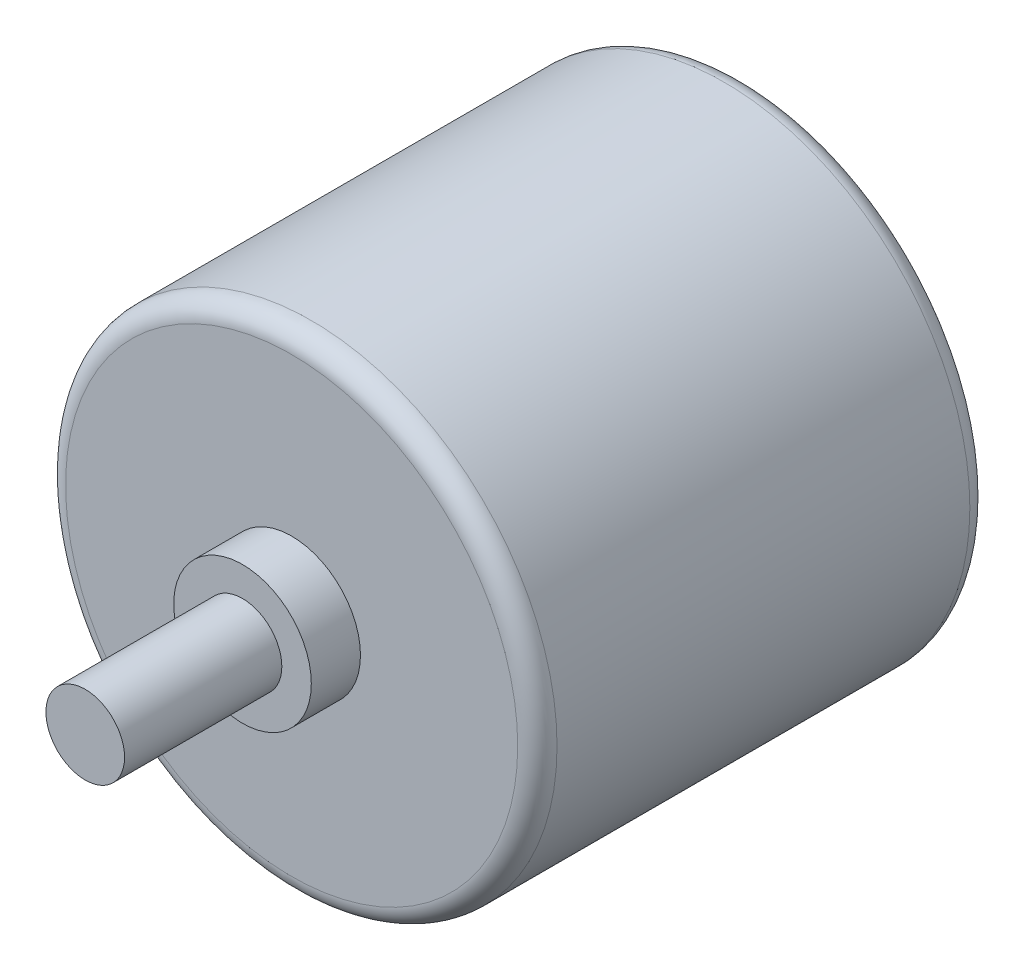
ISO-10303-21;
HEADER;
FILE_DESCRIPTION(('STEP AP214'),'2;1');
FILE_NAME('part.step','',(''),(''),'','','');
FILE_SCHEMA(('AUTOMOTIVE_DESIGN { 1 0 10303 214 1 1 1 1 }'));
ENDSEC;
DATA;
#1=APPLICATION_CONTEXT('core data for automotive mechanical design processes');
#2=APPLICATION_PROTOCOL_DEFINITION('international standard','automotive_design',2000,#1);
#3=PRODUCT_CONTEXT('',#1,'mechanical');
#4=PRODUCT('Part','Part','',(#3));
#5=PRODUCT_RELATED_PRODUCT_CATEGORY('part','',(#4));
#6=PRODUCT_DEFINITION_FORMATION('','',#4);
#7=PRODUCT_DEFINITION_CONTEXT('part definition',#1,'design');
#8=PRODUCT_DEFINITION('design','',#6,#7);
#9=PRODUCT_DEFINITION_SHAPE('','',#8);
#10=(LENGTH_UNIT() NAMED_UNIT(*) SI_UNIT(.MILLI.,.METRE.));
#11=(NAMED_UNIT(*) PLANE_ANGLE_UNIT() SI_UNIT($,.RADIAN.));
#12=(NAMED_UNIT(*) SI_UNIT($,.STERADIAN.) SOLID_ANGLE_UNIT());
#13=UNCERTAINTY_MEASURE_WITH_UNIT(LENGTH_MEASURE(1.E-05),#10,'distance_accuracy_value','');
#14=(GEOMETRIC_REPRESENTATION_CONTEXT(3) GLOBAL_UNCERTAINTY_ASSIGNED_CONTEXT((#13)) GLOBAL_UNIT_ASSIGNED_CONTEXT((#10,
#11,#12)) REPRESENTATION_CONTEXT('',''));
#15=CARTESIAN_POINT('',(0.,0.,0.));
#16=DIRECTION('',(0.,0.,1.));
#17=DIRECTION('',(1.,0.,0.));
#18=AXIS2_PLACEMENT_3D('',#15,#16,#17);
#19=CARTESIAN_POINT('',(0.,0.,25.5));
#20=DIRECTION('',(0.,0.,1.));
#21=DIRECTION('',(1.,0.,0.));
#22=AXIS2_PLACEMENT_3D('',#19,#20,#21);
#23=PLANE('',#22);
#24=CARTESIAN_POINT('',(0.,0.,25.5));
#25=DIRECTION('',(0.,0.,1.));
#26=DIRECTION('',(1.,0.,0.));
#27=AXIS2_PLACEMENT_3D('',#24,#25,#26);
#28=CIRCLE('',#27,3.5);
#29=CARTESIAN_POINT('',(3.5,0.,25.5));
#30=VERTEX_POINT('',#29);
#31=EDGE_CURVE('E50',#30,#30,#28,.T.);
#32=ORIENTED_EDGE('',*,*,#31,.T.);
#33=EDGE_LOOP('',(#32));
#34=FACE_BOUND('',#33,.T.);
#35=CARTESIAN_POINT('',(0.,0.,25.5));
#36=DIRECTION('',(0.,0.,1.));
#37=DIRECTION('',(1.,0.,0.));
#38=AXIS2_PLACEMENT_3D('',#35,#36,#37);
#39=CIRCLE('',#38,2.);
#40=CARTESIAN_POINT('',(2.,0.,25.5));
#41=VERTEX_POINT('',#40);
#42=EDGE_CURVE('E57',#41,#41,#39,.T.);
#43=ORIENTED_EDGE('',*,*,#42,.F.);
#44=EDGE_LOOP('',(#43));
#45=FACE_BOUND('',#44,.T.);
#46=ADVANCED_FACE('F30',(#34,#45),#23,.T.);
#47=CARTESIAN_POINT('',(0.,0.,23.));
#48=DIRECTION('',(0.,0.,1.));
#49=DIRECTION('',(1.,0.,0.));
#50=AXIS2_PLACEMENT_3D('',#47,#48,#49);
#51=PLANE('',#50);
#52=CARTESIAN_POINT('',(0.,0.,23.));
#53=DIRECTION('',(0.,0.,1.));
#54=DIRECTION('',(1.,0.,0.));
#55=AXIS2_PLACEMENT_3D('',#52,#53,#54);
#56=CIRCLE('',#55,11.5);
#57=CARTESIAN_POINT('',(11.5,0.,23.));
#58=VERTEX_POINT('',#57);
#59=EDGE_CURVE('E10',#58,#58,#56,.T.);
#60=ORIENTED_EDGE('',*,*,#59,.T.);
#61=EDGE_LOOP('',(#60));
#62=FACE_BOUND('',#61,.T.);
#63=CARTESIAN_POINT('',(0.,0.,23.));
#64=DIRECTION('',(0.,0.,1.));
#65=DIRECTION('',(1.,0.,0.));
#66=AXIS2_PLACEMENT_3D('',#63,#64,#65);
#67=CIRCLE('',#66,3.5);
#68=CARTESIAN_POINT('',(3.5,0.,23.));
#69=VERTEX_POINT('',#68);
#70=EDGE_CURVE('E51',#69,#69,#67,.T.);
#71=ORIENTED_EDGE('',*,*,#70,.F.);
#72=EDGE_LOOP('',(#71));
#73=FACE_BOUND('',#72,.T.);
#74=ADVANCED_FACE('F72',(#62,#73),#51,.T.);
#75=CARTESIAN_POINT('',(0.,0.,23.));
#76=DIRECTION('',(0.,0.,-1.));
#77=DIRECTION('',(-1.,0.,0.));
#78=AXIS2_PLACEMENT_3D('',#75,#76,#77);
#79=CYLINDRICAL_SURFACE('',#78,12.5);
#80=CARTESIAN_POINT('',(0.,0.,1.));
#81=DIRECTION('',(0.,0.,1.));
#82=DIRECTION('',(1.,0.,0.));
#83=AXIS2_PLACEMENT_3D('',#80,#81,#82);
#84=CIRCLE('',#83,12.5);
#85=CARTESIAN_POINT('',(12.5,0.,1.));
#86=VERTEX_POINT('',#85);
#87=EDGE_CURVE('E41',#86,#86,#84,.T.);
#88=ORIENTED_EDGE('',*,*,#87,.T.);
#89=EDGE_LOOP('',(#88));
#90=FACE_BOUND('',#89,.T.);
#91=CARTESIAN_POINT('',(0.,0.,22.));
#92=DIRECTION('',(0.,0.,1.));
#93=DIRECTION('',(1.,0.,0.));
#94=AXIS2_PLACEMENT_3D('',#91,#92,#93);
#95=CIRCLE('',#94,12.5);
#96=CARTESIAN_POINT('',(12.5,0.,22.));
#97=VERTEX_POINT('',#96);
#98=EDGE_CURVE('E45',#97,#97,#95,.F.);
#99=ORIENTED_EDGE('',*,*,#98,.T.);
#100=EDGE_LOOP('',(#99));
#101=FACE_BOUND('',#100,.T.);
#102=ADVANCED_FACE('F78',(#90,#101),#79,.T.);
#103=CARTESIAN_POINT('',(0.,0.,0.));
#104=DIRECTION('',(0.,0.,1.));
#105=DIRECTION('',(1.,0.,0.));
#106=AXIS2_PLACEMENT_3D('',#103,#104,#105);
#107=PLANE('',#106);
#108=CARTESIAN_POINT('',(0.,0.,0.));
#109=DIRECTION('',(0.,0.,1.));
#110=DIRECTION('',(1.,0.,0.));
#111=AXIS2_PLACEMENT_3D('',#108,#109,#110);
#112=CIRCLE('',#111,11.5);
#113=CARTESIAN_POINT('',(11.5,0.,0.));
#114=VERTEX_POINT('',#113);
#115=EDGE_CURVE('E37',#114,#114,#112,.F.);
#116=ORIENTED_EDGE('',*,*,#115,.T.);
#117=EDGE_LOOP('',(#116));
#118=FACE_BOUND('',#117,.T.);
#119=ADVANCED_FACE('F85',(#118),#107,.F.);
#120=CARTESIAN_POINT('',(0.,0.,25.5));
#121=DIRECTION('',(0.,0.,-1.));
#122=DIRECTION('',(-1.,0.,0.));
#123=AXIS2_PLACEMENT_3D('',#120,#121,#122);
#124=CYLINDRICAL_SURFACE('',#123,3.5);
#125=ORIENTED_EDGE('',*,*,#31,.F.);
#126=EDGE_LOOP('',(#125));
#127=FACE_BOUND('',#126,.T.);
#128=ORIENTED_EDGE('',*,*,#70,.T.);
#129=EDGE_LOOP('',(#128));
#130=FACE_BOUND('',#129,.T.);
#131=ADVANCED_FACE('F82',(#127,#130),#124,.T.);
#132=CARTESIAN_POINT('',(0.,0.,1.));
#133=DIRECTION('',(0.,0.,1.));
#134=DIRECTION('',(1.,0.,0.));
#135=AXIS2_PLACEMENT_3D('',#132,#133,#134);
#136=TOROIDAL_SURFACE('',#135,11.5,1.);
#137=ORIENTED_EDGE('',*,*,#115,.F.);
#138=EDGE_LOOP('',(#137));
#139=FACE_BOUND('',#138,.T.);
#140=ORIENTED_EDGE('',*,*,#87,.F.);
#141=EDGE_LOOP('',(#140));
#142=FACE_BOUND('',#141,.T.);
#143=ADVANCED_FACE('F84',(#139,#142),#136,.T.);
#144=CARTESIAN_POINT('',(0.,0.,22.));
#145=DIRECTION('',(0.,0.,1.));
#146=DIRECTION('',(1.,0.,0.));
#147=AXIS2_PLACEMENT_3D('',#144,#145,#146);
#148=TOROIDAL_SURFACE('',#147,11.5,1.);
#149=ORIENTED_EDGE('',*,*,#98,.F.);
#150=EDGE_LOOP('',(#149));
#151=FACE_BOUND('',#150,.T.);
#152=ORIENTED_EDGE('',*,*,#59,.F.);
#153=EDGE_LOOP('',(#152));
#154=FACE_BOUND('',#153,.T.);
#155=ADVANCED_FACE('F32',(#151,#154),#148,.T.);
#156=CARTESIAN_POINT('',(0.,0.,33.5));
#157=DIRECTION('',(0.,0.,-1.));
#158=DIRECTION('',(-1.,0.,0.));
#159=AXIS2_PLACEMENT_3D('',#156,#157,#158);
#160=CYLINDRICAL_SURFACE('',#159,2.);
#161=CARTESIAN_POINT('',(0.,0.,33.5));
#162=DIRECTION('',(0.,0.,1.));
#163=DIRECTION('',(1.,0.,0.));
#164=AXIS2_PLACEMENT_3D('',#161,#162,#163);
#165=CIRCLE('',#164,2.);
#166=CARTESIAN_POINT('',(2.,0.,33.5));
#167=VERTEX_POINT('',#166);
#168=EDGE_CURVE('E54',#167,#167,#165,.T.);
#169=ORIENTED_EDGE('',*,*,#168,.F.);
#170=EDGE_LOOP('',(#169));
#171=FACE_BOUND('',#170,.T.);
#172=ORIENTED_EDGE('',*,*,#42,.T.);
#173=EDGE_LOOP('',(#172));
#174=FACE_BOUND('',#173,.T.);
#175=ADVANCED_FACE('F65',(#171,#174),#160,.T.);
#176=CARTESIAN_POINT('',(0.,0.,33.5));
#177=DIRECTION('',(0.,0.,1.));
#178=DIRECTION('',(1.,0.,0.));
#179=AXIS2_PLACEMENT_3D('',#176,#177,#178);
#180=PLANE('',#179);
#181=ORIENTED_EDGE('',*,*,#168,.T.);
#182=EDGE_LOOP('',(#181));
#183=FACE_BOUND('',#182,.T.);
#184=ADVANCED_FACE('F63',(#183),#180,.T.);
#185=CLOSED_SHELL('',(#46,#74,#102,#119,#131,#143,#155,#175,#184));
#186=MANIFOLD_SOLID_BREP('B2',#185);
#187=ADVANCED_BREP_SHAPE_REPRESENTATION('',(#18,#186),#14);
#188=SHAPE_DEFINITION_REPRESENTATION(#9,#187);
ENDSEC;
END-ISO-10303-21;
